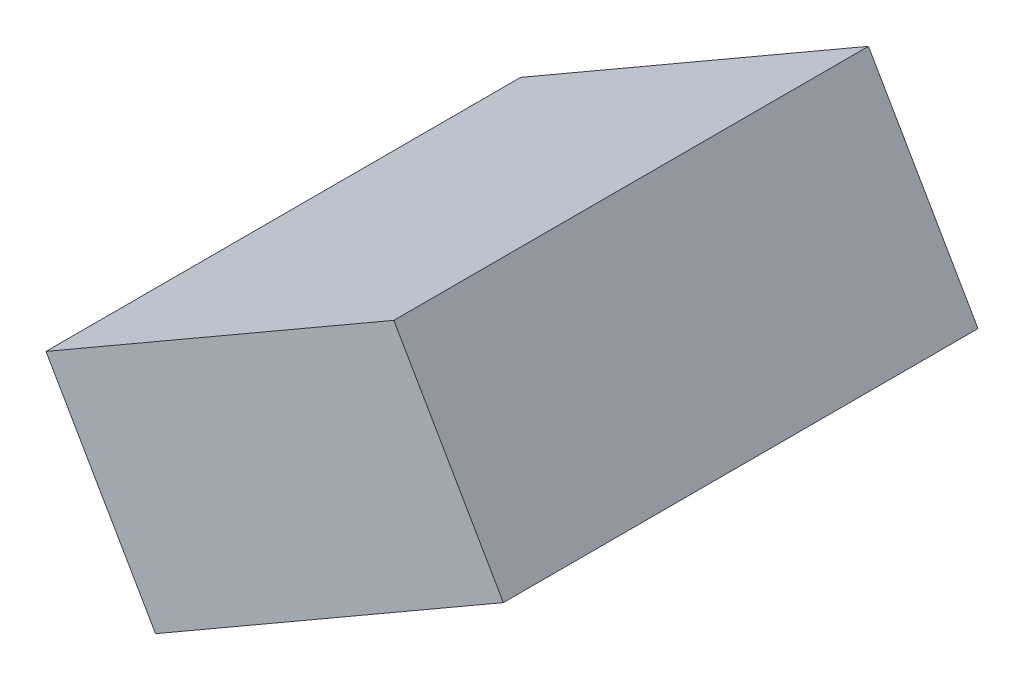
ISO-10303-21;
HEADER;
FILE_DESCRIPTION(('STEP AP214'),'2;1');
FILE_NAME('part.step','',(''),(''),'','','');
FILE_SCHEMA(('AUTOMOTIVE_DESIGN { 1 0 10303 214 1 1 1 1 }'));
ENDSEC;
DATA;
#1=APPLICATION_CONTEXT('core data for automotive mechanical design processes');
#2=APPLICATION_PROTOCOL_DEFINITION('international standard','automotive_design',2000,#1);
#3=PRODUCT_CONTEXT('',#1,'mechanical');
#4=PRODUCT('Part','Part','',(#3));
#5=PRODUCT_RELATED_PRODUCT_CATEGORY('part','',(#4));
#6=PRODUCT_DEFINITION_FORMATION('','',#4);
#7=PRODUCT_DEFINITION_CONTEXT('part definition',#1,'design');
#8=PRODUCT_DEFINITION('design','',#6,#7);
#9=PRODUCT_DEFINITION_SHAPE('','',#8);
#10=(LENGTH_UNIT() NAMED_UNIT(*) SI_UNIT(.MILLI.,.METRE.));
#11=(NAMED_UNIT(*) PLANE_ANGLE_UNIT() SI_UNIT($,.RADIAN.));
#12=(NAMED_UNIT(*) SI_UNIT($,.STERADIAN.) SOLID_ANGLE_UNIT());
#13=UNCERTAINTY_MEASURE_WITH_UNIT(LENGTH_MEASURE(1.E-05),#10,'distance_accuracy_value','');
#14=(GEOMETRIC_REPRESENTATION_CONTEXT(3) GLOBAL_UNCERTAINTY_ASSIGNED_CONTEXT((#13)) GLOBAL_UNIT_ASSIGNED_CONTEXT((#10,
#11,#12)) REPRESENTATION_CONTEXT('',''));
#15=CARTESIAN_POINT('',(0.,0.,0.));
#16=DIRECTION('',(0.,0.,1.));
#17=DIRECTION('',(1.,0.,0.));
#18=AXIS2_PLACEMENT_3D('',#15,#16,#17);
#19=CARTESIAN_POINT('',(-0.32630872,-0.53480462,0.));
#20=DIRECTION('',(-0.499999889580193,0.866025467535334,0.));
#21=DIRECTION('',(-0.866025467535334,-0.499999889580193,0.));
#22=AXIS2_PLACEMENT_3D('',#19,#20,#21);
#23=PLANE('',#22);
#24=DIRECTION('',(0.,0.,1.));
#25=VECTOR('',#24,1.);
#26=CARTESIAN_POINT('',(0.6263132,0.01519173999998,0.));
#27=LINE('',#26,#25);
#28=CARTESIAN_POINT('',(0.626313200000005,0.0151917399999707,0.));
#29=VERTEX_POINT('',#28);
#30=CARTESIAN_POINT('',(0.626313200000005,0.0151917399999707,1.29999994));
#31=VERTEX_POINT('',#30);
#32=EDGE_CURVE('E19',#29,#31,#27,.T.);
#33=ORIENTED_EDGE('',*,*,#32,.T.);
#34=DIRECTION('',(-0.866025467535315,-0.499999889580227,0.));
#35=VECTOR('',#34,1.);
#36=CARTESIAN_POINT('',(0.6263132,0.01519173999998,1.29999994));
#37=LINE('',#36,#35);
#38=CARTESIAN_POINT('',(-0.326308719999959,-0.534804619999976,1.29999994));
#39=VERTEX_POINT('',#38);
#40=EDGE_CURVE('E54',#31,#39,#37,.T.);
#41=ORIENTED_EDGE('',*,*,#40,.T.);
#42=DIRECTION('',(0.,0.,1.));
#43=VECTOR('',#42,1.);
#44=CARTESIAN_POINT('',(-0.326308719999837,-0.534804619999906,0.));
#45=LINE('',#44,#43);
#46=CARTESIAN_POINT('',(-0.326308719999959,-0.534804619999976,0.));
#47=VERTEX_POINT('',#46);
#48=EDGE_CURVE('E75',#39,#47,#45,.F.);
#49=ORIENTED_EDGE('',*,*,#48,.T.);
#50=DIRECTION('',(-0.866025467535315,-0.499999889580227,0.));
#51=VECTOR('',#50,1.);
#52=CARTESIAN_POINT('',(0.6263132,0.01519173999998,0.));
#53=LINE('',#52,#51);
#54=EDGE_CURVE('E57',#29,#47,#53,.T.);
#55=ORIENTED_EDGE('',*,*,#54,.F.);
#56=EDGE_LOOP('',(#33,#41,#49,#55));
#57=FACE_BOUND('',#56,.T.);
#58=ADVANCED_FACE('F16',(#57),#23,.F.);
#59=CARTESIAN_POINT('',(0.6263132,0.01519173999998,0.));
#60=DIRECTION('',(-0.866027743934068,-0.499995946720039,0.));
#61=DIRECTION('',(0.499995946720039,-0.866027743934068,0.));
#62=AXIS2_PLACEMENT_3D('',#59,#60,#61);
#63=PLANE('',#62);
#64=DIRECTION('',(0.,0.,1.));
#65=VECTOR('',#64,1.);
#66=CARTESIAN_POINT('',(0.32631634,0.53480716,0.));
#67=LINE('',#66,#65);
#68=CARTESIAN_POINT('',(0.326316339999941,0.534807159999966,0.));
#69=VERTEX_POINT('',#68);
#70=CARTESIAN_POINT('',(0.326316339999941,0.534807159999966,1.29999994));
#71=VERTEX_POINT('',#70);
#72=EDGE_CURVE('E72',#69,#71,#67,.T.);
#73=ORIENTED_EDGE('',*,*,#72,.T.);
#74=DIRECTION('',(0.499995946719843,-0.866027743934182,0.));
#75=VECTOR('',#74,1.);
#76=CARTESIAN_POINT('',(0.32631634,0.53480716,1.29999994));
#77=LINE('',#76,#75);
#78=EDGE_CURVE('E62',#71,#31,#77,.T.);
#79=ORIENTED_EDGE('',*,*,#78,.T.);
#80=ORIENTED_EDGE('',*,*,#32,.F.);
#81=DIRECTION('',(0.499995946719843,-0.866027743934182,0.));
#82=VECTOR('',#81,1.);
#83=CARTESIAN_POINT('',(0.32631634,0.53480716,0.));
#84=LINE('',#83,#82);
#85=EDGE_CURVE('E77',#69,#29,#84,.T.);
#86=ORIENTED_EDGE('',*,*,#85,.F.);
#87=EDGE_LOOP('',(#73,#79,#80,#86));
#88=FACE_BOUND('',#87,.T.);
#89=ADVANCED_FACE('F71',(#88),#63,.F.);
#90=CARTESIAN_POINT('',(0.32631634,0.53480716,1.29999994));
#91=DIRECTION('',(0.,0.,-1.));
#92=DIRECTION('',(-1.,0.,0.));
#93=AXIS2_PLACEMENT_3D('',#90,#91,#92);
#94=PLANE('',#93);
#95=DIRECTION('',(-0.500002296729118,0.866024077763204,0.));
#96=VECTOR('',#95,1.);
#97=CARTESIAN_POINT('',(-0.62631066,-0.01518920000001,1.29999994));
#98=LINE('',#97,#96);
#99=CARTESIAN_POINT('',(-0.626310660000023,-0.0151891999999696,1.29999994));
#100=VERTEX_POINT('',#99);
#101=EDGE_CURVE('E68',#100,#39,#98,.F.);
#102=ORIENTED_EDGE('',*,*,#101,.T.);
#103=ORIENTED_EDGE('',*,*,#40,.F.);
#104=ORIENTED_EDGE('',*,*,#78,.F.);
#105=DIRECTION('',(0.866026622080792,0.49999788984288,0.));
#106=VECTOR('',#105,1.);
#107=CARTESIAN_POINT('',(0.32631634,0.53480716,1.29999994));
#108=LINE('',#107,#106);
#109=EDGE_CURVE('E82',#71,#100,#108,.F.);
#110=ORIENTED_EDGE('',*,*,#109,.T.);
#111=EDGE_LOOP('',(#102,#103,#104,#110));
#112=FACE_BOUND('',#111,.T.);
#113=ADVANCED_FACE('F65',(#112),#94,.F.);
#114=CARTESIAN_POINT('',(-0.62631066,-0.01518920000001,0.));
#115=DIRECTION('',(0.866024077763204,0.500002296729118,0.));
#116=DIRECTION('',(-0.500002296729118,0.866024077763204,0.));
#117=AXIS2_PLACEMENT_3D('',#114,#115,#116);
#118=PLANE('',#117);
#119=ORIENTED_EDGE('',*,*,#48,.F.);
#120=ORIENTED_EDGE('',*,*,#101,.F.);
#121=DIRECTION('',(0.,0.,1.));
#122=VECTOR('',#121,1.);
#123=CARTESIAN_POINT('',(-0.626310660000093,-0.0151891999998483,0.));
#124=LINE('',#123,#122);
#125=CARTESIAN_POINT('',(-0.626310660000023,-0.0151891999999696,0.));
#126=VERTEX_POINT('',#125);
#127=EDGE_CURVE('E25',#100,#126,#124,.F.);
#128=ORIENTED_EDGE('',*,*,#127,.T.);
#129=DIRECTION('',(-0.500002296728846,0.86602407776336,0.));
#130=VECTOR('',#129,1.);
#131=CARTESIAN_POINT('',(-0.32630872,-0.53480462,0.));
#132=LINE('',#131,#130);
#133=EDGE_CURVE('E33',#47,#126,#132,.T.);
#134=ORIENTED_EDGE('',*,*,#133,.F.);
#135=EDGE_LOOP('',(#119,#120,#128,#134));
#136=FACE_BOUND('',#135,.T.);
#137=ADVANCED_FACE('F87',(#136),#118,.F.);
#138=CARTESIAN_POINT('',(0.32631634,0.53480716,0.));
#139=DIRECTION('',(0.,0.,-1.));
#140=DIRECTION('',(-1.,0.,0.));
#141=AXIS2_PLACEMENT_3D('',#138,#139,#140);
#142=PLANE('',#141);
#143=ORIENTED_EDGE('',*,*,#133,.T.);
#144=DIRECTION('',(0.866026622080792,0.49999788984288,0.));
#145=VECTOR('',#144,1.);
#146=CARTESIAN_POINT('',(0.32631634,0.53480716,0.));
#147=LINE('',#146,#145);
#148=EDGE_CURVE('E11',#126,#69,#147,.T.);
#149=ORIENTED_EDGE('',*,*,#148,.T.);
#150=ORIENTED_EDGE('',*,*,#85,.T.);
#151=ORIENTED_EDGE('',*,*,#54,.T.);
#152=EDGE_LOOP('',(#143,#149,#150,#151));
#153=FACE_BOUND('',#152,.T.);
#154=ADVANCED_FACE('F90',(#153),#142,.T.);
#155=CARTESIAN_POINT('',(0.32631634,0.53480716,0.));
#156=DIRECTION('',(0.49999788984288,-0.866026622080792,0.));
#157=DIRECTION('',(0.866026622080792,0.49999788984288,0.));
#158=AXIS2_PLACEMENT_3D('',#155,#156,#157);
#159=PLANE('',#158);
#160=ORIENTED_EDGE('',*,*,#127,.F.);
#161=ORIENTED_EDGE('',*,*,#109,.F.);
#162=ORIENTED_EDGE('',*,*,#72,.F.);
#163=ORIENTED_EDGE('',*,*,#148,.F.);
#164=EDGE_LOOP('',(#160,#161,#162,#163));
#165=FACE_BOUND('',#164,.T.);
#166=ADVANCED_FACE('F89',(#165),#159,.F.);
#167=CLOSED_SHELL('',(#58,#89,#113,#137,#154,#166));
#168=MANIFOLD_SOLID_BREP('B1',#167);
#169=ADVANCED_BREP_SHAPE_REPRESENTATION('',(#18,#168),#14);
#170=SHAPE_DEFINITION_REPRESENTATION(#9,#169);
ENDSEC;
END-ISO-10303-21;
